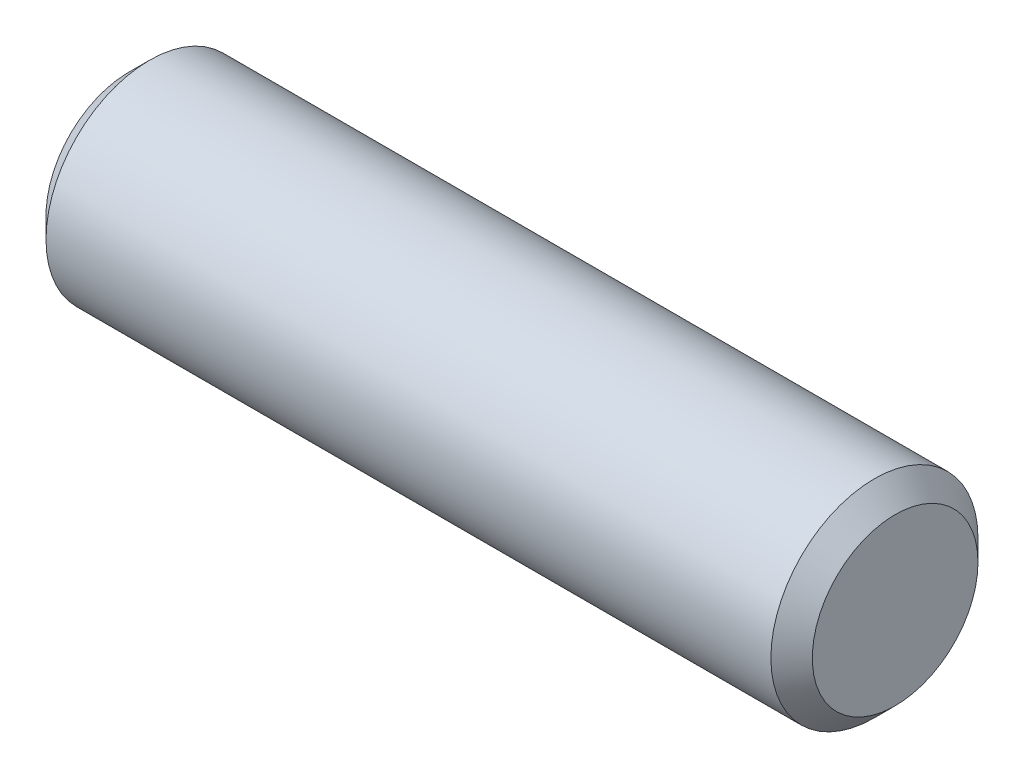
ISO-10303-21;
HEADER;
FILE_DESCRIPTION(('STEP AP214'),'2;1');
FILE_NAME('part.step','',(''),(''),'','','');
FILE_SCHEMA(('AUTOMOTIVE_DESIGN { 1 0 10303 214 1 1 1 1 }'));
ENDSEC;
DATA;
#1=APPLICATION_CONTEXT('core data for automotive mechanical design processes');
#2=APPLICATION_PROTOCOL_DEFINITION('international standard','automotive_design',2000,#1);
#3=PRODUCT_CONTEXT('',#1,'mechanical');
#4=PRODUCT('Part','Part','',(#3));
#5=PRODUCT_RELATED_PRODUCT_CATEGORY('part','',(#4));
#6=PRODUCT_DEFINITION_FORMATION('','',#4);
#7=PRODUCT_DEFINITION_CONTEXT('part definition',#1,'design');
#8=PRODUCT_DEFINITION('design','',#6,#7);
#9=PRODUCT_DEFINITION_SHAPE('','',#8);
#10=(LENGTH_UNIT() NAMED_UNIT(*) SI_UNIT(.MILLI.,.METRE.));
#11=(NAMED_UNIT(*) PLANE_ANGLE_UNIT() SI_UNIT($,.RADIAN.));
#12=(NAMED_UNIT(*) SI_UNIT($,.STERADIAN.) SOLID_ANGLE_UNIT());
#13=UNCERTAINTY_MEASURE_WITH_UNIT(LENGTH_MEASURE(1.E-05),#10,'distance_accuracy_value','');
#14=(GEOMETRIC_REPRESENTATION_CONTEXT(3) GLOBAL_UNCERTAINTY_ASSIGNED_CONTEXT((#13)) GLOBAL_UNIT_ASSIGNED_CONTEXT((#10,
#11,#12)) REPRESENTATION_CONTEXT('',''));
#15=CARTESIAN_POINT('',(0.,0.,0.));
#16=DIRECTION('',(0.,0.,1.));
#17=DIRECTION('',(1.,0.,0.));
#18=AXIS2_PLACEMENT_3D('',#15,#16,#17);
#19=CARTESIAN_POINT('',(74.,0.,0.));
#20=DIRECTION('',(-1.,0.,0.));
#21=DIRECTION('',(0.,0.,1.));
#22=AXIS2_PLACEMENT_3D('',#19,#20,#21);
#23=CYLINDRICAL_SURFACE('',#22,10.);
#24=CARTESIAN_POINT('',(2.00000000000003,0.,0.));
#25=DIRECTION('',(1.,0.,0.));
#26=DIRECTION('',(0.,0.,-1.));
#27=AXIS2_PLACEMENT_3D('',#24,#25,#26);
#28=CIRCLE('',#27,10.);
#29=CARTESIAN_POINT('',(2.00000000000003,0.,-10.));
#30=VERTEX_POINT('',#29);
#31=EDGE_CURVE('E59',#30,#30,#28,.T.);
#32=ORIENTED_EDGE('',*,*,#31,.T.);
#33=EDGE_LOOP('',(#32));
#34=FACE_BOUND('',#33,.T.);
#35=CARTESIAN_POINT('',(72.,0.,0.));
#36=DIRECTION('',(1.,0.,0.));
#37=DIRECTION('',(0.,0.,-1.));
#38=AXIS2_PLACEMENT_3D('',#35,#36,#37);
#39=CIRCLE('',#38,10.);
#40=CARTESIAN_POINT('',(72.,0.,-10.));
#41=VERTEX_POINT('',#40);
#42=EDGE_CURVE('E63',#41,#41,#39,.F.);
#43=ORIENTED_EDGE('',*,*,#42,.T.);
#44=EDGE_LOOP('',(#43));
#45=FACE_BOUND('',#44,.T.);
#46=ADVANCED_FACE('F47',(#34,#45),#23,.T.);
#47=CARTESIAN_POINT('',(74.,0.,0.));
#48=DIRECTION('',(1.,0.,0.));
#49=DIRECTION('',(0.,0.,-1.));
#50=AXIS2_PLACEMENT_3D('',#47,#48,#49);
#51=PLANE('',#50);
#52=CARTESIAN_POINT('',(74.,0.,0.));
#53=DIRECTION('',(1.,0.,0.));
#54=DIRECTION('',(0.,0.,-1.));
#55=AXIS2_PLACEMENT_3D('',#52,#53,#54);
#56=CIRCLE('',#55,7.99999999999999);
#57=CARTESIAN_POINT('',(74.,0.,-7.99999999999999));
#58=VERTEX_POINT('',#57);
#59=EDGE_CURVE('E10',#58,#58,#56,.T.);
#60=ORIENTED_EDGE('',*,*,#59,.T.);
#61=EDGE_LOOP('',(#60));
#62=FACE_BOUND('',#61,.T.);
#63=ADVANCED_FACE('F79',(#62),#51,.T.);
#64=CARTESIAN_POINT('',(0.,0.,0.));
#65=DIRECTION('',(1.,0.,0.));
#66=DIRECTION('',(0.,0.,-1.));
#67=AXIS2_PLACEMENT_3D('',#64,#65,#66);
#68=PLANE('',#67);
#69=CARTESIAN_POINT('',(0.,0.,0.));
#70=DIRECTION('',(1.,0.,0.));
#71=DIRECTION('',(0.,0.,-1.));
#72=AXIS2_PLACEMENT_3D('',#69,#70,#71);
#73=CIRCLE('',#72,7.99999999999997);
#74=CARTESIAN_POINT('',(0.,0.,-7.99999999999997));
#75=VERTEX_POINT('',#74);
#76=EDGE_CURVE('E55',#75,#75,#73,.F.);
#77=ORIENTED_EDGE('',*,*,#76,.T.);
#78=EDGE_LOOP('',(#77));
#79=FACE_BOUND('',#78,.T.);
#80=ADVANCED_FACE('F76',(#79),#68,.F.);
#81=CARTESIAN_POINT('',(2.00000000000003,0.,0.));
#82=DIRECTION('',(1.,0.,0.));
#83=DIRECTION('',(0.,0.,-1.));
#84=AXIS2_PLACEMENT_3D('',#81,#82,#83);
#85=CONICAL_SURFACE('',#84,10.,0.78539816339745);
#86=ORIENTED_EDGE('',*,*,#76,.F.);
#87=EDGE_LOOP('',(#86));
#88=FACE_BOUND('',#87,.T.);
#89=ORIENTED_EDGE('',*,*,#31,.F.);
#90=EDGE_LOOP('',(#89));
#91=FACE_BOUND('',#90,.T.);
#92=ADVANCED_FACE('F72',(#88,#91),#85,.T.);
#93=CARTESIAN_POINT('',(74.,0.,0.));
#94=DIRECTION('',(-1.,0.,0.));
#95=DIRECTION('',(0.,0.,1.));
#96=AXIS2_PLACEMENT_3D('',#93,#94,#95);
#97=CONICAL_SURFACE('',#96,7.99999999999999,0.785398163397446);
#98=ORIENTED_EDGE('',*,*,#42,.F.);
#99=EDGE_LOOP('',(#98));
#100=FACE_BOUND('',#99,.T.);
#101=ORIENTED_EDGE('',*,*,#59,.F.);
#102=EDGE_LOOP('',(#101));
#103=FACE_BOUND('',#102,.T.);
#104=ADVANCED_FACE('F50',(#100,#103),#97,.T.);
#105=CLOSED_SHELL('',(#46,#63,#80,#92,#104));
#106=MANIFOLD_SOLID_BREP('B2',#105);
#107=ADVANCED_BREP_SHAPE_REPRESENTATION('',(#18,#106),#14);
#108=SHAPE_DEFINITION_REPRESENTATION(#9,#107);
ENDSEC;
END-ISO-10303-21;
